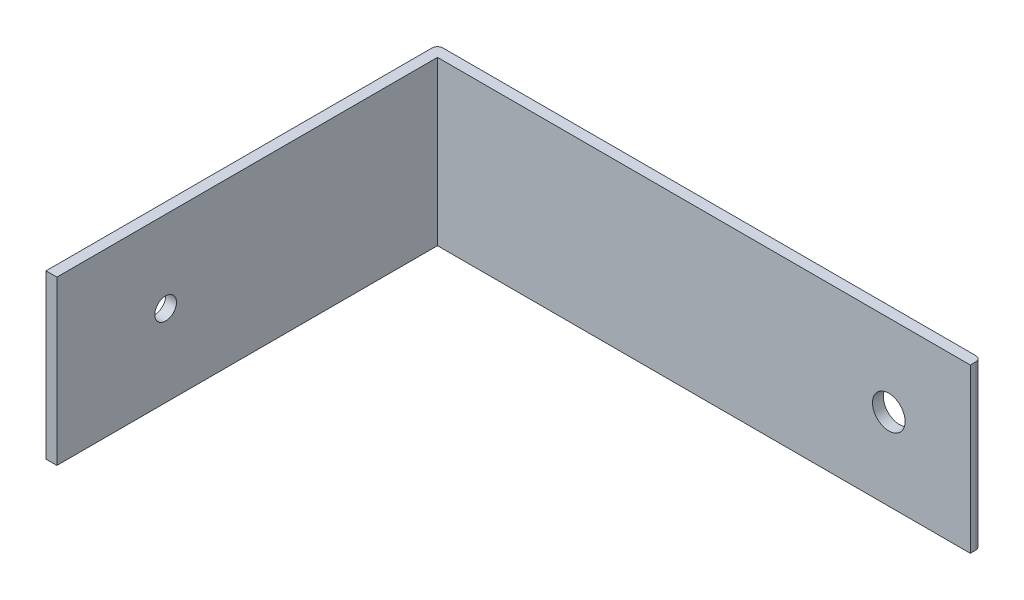
ISO-10303-21;
HEADER;
FILE_DESCRIPTION(('STEP AP214'),'2;1');
FILE_NAME('part.step','',(''),(''),'','','');
FILE_SCHEMA(('AUTOMOTIVE_DESIGN { 1 0 10303 214 1 1 1 1 }'));
ENDSEC;
DATA;
#1=APPLICATION_CONTEXT('core data for automotive mechanical design processes');
#2=APPLICATION_PROTOCOL_DEFINITION('international standard','automotive_design',2000,#1);
#3=PRODUCT_CONTEXT('',#1,'mechanical');
#4=PRODUCT('Part','Part','',(#3));
#5=PRODUCT_RELATED_PRODUCT_CATEGORY('part','',(#4));
#6=PRODUCT_DEFINITION_FORMATION('','',#4);
#7=PRODUCT_DEFINITION_CONTEXT('part definition',#1,'design');
#8=PRODUCT_DEFINITION('design','',#6,#7);
#9=PRODUCT_DEFINITION_SHAPE('','',#8);
#10=(LENGTH_UNIT() NAMED_UNIT(*) SI_UNIT(.MILLI.,.METRE.));
#11=(NAMED_UNIT(*) PLANE_ANGLE_UNIT() SI_UNIT($,.RADIAN.));
#12=(NAMED_UNIT(*) SI_UNIT($,.STERADIAN.) SOLID_ANGLE_UNIT());
#13=UNCERTAINTY_MEASURE_WITH_UNIT(LENGTH_MEASURE(1.E-05),#10,'distance_accuracy_value','');
#14=(GEOMETRIC_REPRESENTATION_CONTEXT(3) GLOBAL_UNCERTAINTY_ASSIGNED_CONTEXT((#13)) GLOBAL_UNIT_ASSIGNED_CONTEXT((#10,
#11,#12)) REPRESENTATION_CONTEXT('',''));
#15=CARTESIAN_POINT('',(0.,0.,0.));
#16=DIRECTION('',(0.,0.,1.));
#17=DIRECTION('',(1.,0.,0.));
#18=AXIS2_PLACEMENT_3D('',#15,#16,#17);
#19=CARTESIAN_POINT('',(0.,0.,2.));
#20=DIRECTION('',(1.,0.,0.));
#21=DIRECTION('',(0.,1.,0.));
#22=AXIS2_PLACEMENT_3D('',#19,#20,#21);
#23=PLANE('',#22);
#24=CARTESIAN_POINT('',(0.,-15.,52.));
#25=DIRECTION('',(-1.,0.,0.));
#26=DIRECTION('',(0.,-1.,0.));
#27=AXIS2_PLACEMENT_3D('',#24,#25,#26);
#28=CIRCLE('',#27,2.);
#29=CARTESIAN_POINT('',(0.,-17.,52.));
#30=VERTEX_POINT('',#29);
#31=EDGE_CURVE('E128',#30,#30,#28,.T.);
#32=ORIENTED_EDGE('',*,*,#31,.F.);
#33=EDGE_LOOP('',(#32));
#34=FACE_BOUND('',#33,.T.);
#35=DIRECTION('',(0.,0.,-1.));
#36=VECTOR('',#35,1.);
#37=CARTESIAN_POINT('',(0.,0.,2.));
#38=LINE('',#37,#36);
#39=CARTESIAN_POINT('',(0.,0.,72.));
#40=VERTEX_POINT('',#39);
#41=CARTESIAN_POINT('',(0.,0.,1.));
#42=VERTEX_POINT('',#41);
#43=EDGE_CURVE('E176',#40,#42,#38,.T.);
#44=ORIENTED_EDGE('',*,*,#43,.T.);
#45=DIRECTION('',(0.,-1.,0.));
#46=VECTOR('',#45,1.);
#47=CARTESIAN_POINT('',(0.,0.,1.));
#48=LINE('',#47,#46);
#49=CARTESIAN_POINT('',(0.,-30.,1.));
#50=VERTEX_POINT('',#49);
#51=EDGE_CURVE('E104',#42,#50,#48,.T.);
#52=ORIENTED_EDGE('',*,*,#51,.T.);
#53=DIRECTION('',(0.,0.,-1.));
#54=VECTOR('',#53,1.);
#55=CARTESIAN_POINT('',(0.,-30.,2.));
#56=LINE('',#55,#54);
#57=CARTESIAN_POINT('',(0.,-30.,72.));
#58=VERTEX_POINT('',#57);
#59=EDGE_CURVE('E98',#58,#50,#56,.T.);
#60=ORIENTED_EDGE('',*,*,#59,.F.);
#61=DIRECTION('',(0.,-1.,0.));
#62=VECTOR('',#61,1.);
#63=CARTESIAN_POINT('',(0.,0.,72.));
#64=LINE('',#63,#62);
#65=EDGE_CURVE('E102',#40,#58,#64,.T.);
#66=ORIENTED_EDGE('',*,*,#65,.F.);
#67=EDGE_LOOP('',(#44,#52,#60,#66));
#68=FACE_BOUND('',#67,.T.);
#69=ADVANCED_FACE('F33',(#34,#68),#23,.F.);
#70=CARTESIAN_POINT('',(0.,-30.,2.));
#71=DIRECTION('',(0.,1.,0.));
#72=DIRECTION('',(0.,0.,1.));
#73=AXIS2_PLACEMENT_3D('',#70,#71,#72);
#74=PLANE('',#73);
#75=DIRECTION('',(1.,0.,0.));
#76=VECTOR('',#75,1.);
#77=CARTESIAN_POINT('',(0.,-30.,0.));
#78=LINE('',#77,#76);
#79=CARTESIAN_POINT('',(1.,-30.,0.));
#80=VERTEX_POINT('',#79);
#81=CARTESIAN_POINT('',(99.,-30.,0.));
#82=VERTEX_POINT('',#81);
#83=EDGE_CURVE('E148',#80,#82,#78,.T.);
#84=ORIENTED_EDGE('',*,*,#83,.T.);
#85=CARTESIAN_POINT('',(99.,-30.,1.));
#86=DIRECTION('',(0.,1.,0.));
#87=DIRECTION('',(0.,0.,1.));
#88=AXIS2_PLACEMENT_3D('',#85,#86,#87);
#89=CIRCLE('',#88,1.);
#90=CARTESIAN_POINT('',(100.,-30.,1.));
#91=VERTEX_POINT('',#90);
#92=EDGE_CURVE('E11',#82,#91,#89,.F.);
#93=ORIENTED_EDGE('',*,*,#92,.T.);
#94=DIRECTION('',(0.,0.,-1.));
#95=VECTOR('',#94,1.);
#96=CARTESIAN_POINT('',(100.,-30.,2.));
#97=LINE('',#96,#95);
#98=CARTESIAN_POINT('',(100.,-30.,2.));
#99=VERTEX_POINT('',#98);
#100=EDGE_CURVE('E106',#99,#91,#97,.T.);
#101=ORIENTED_EDGE('',*,*,#100,.F.);
#102=DIRECTION('',(1.,0.,0.));
#103=VECTOR('',#102,1.);
#104=CARTESIAN_POINT('',(0.,-30.,2.));
#105=LINE('',#104,#103);
#106=CARTESIAN_POINT('',(2.,-30.,2.));
#107=VERTEX_POINT('',#106);
#108=EDGE_CURVE('E181',#107,#99,#105,.T.);
#109=ORIENTED_EDGE('',*,*,#108,.F.);
#110=DIRECTION('',(0.,0.,-1.));
#111=VECTOR('',#110,1.);
#112=CARTESIAN_POINT('',(2.,-30.,72.));
#113=LINE('',#112,#111);
#114=CARTESIAN_POINT('',(2.,-30.,72.));
#115=VERTEX_POINT('',#114);
#116=EDGE_CURVE('E113',#115,#107,#113,.T.);
#117=ORIENTED_EDGE('',*,*,#116,.F.);
#118=DIRECTION('',(1.,0.,0.));
#119=VECTOR('',#118,1.);
#120=CARTESIAN_POINT('',(0.,-30.,72.));
#121=LINE('',#120,#119);
#122=EDGE_CURVE('E109',#58,#115,#121,.T.);
#123=ORIENTED_EDGE('',*,*,#122,.F.);
#124=ORIENTED_EDGE('',*,*,#59,.T.);
#125=CARTESIAN_POINT('',(1.,-30.,1.));
#126=DIRECTION('',(0.,1.,0.));
#127=DIRECTION('',(0.,0.,1.));
#128=AXIS2_PLACEMENT_3D('',#125,#126,#127);
#129=CIRCLE('',#128,1.);
#130=EDGE_CURVE('E154',#50,#80,#129,.F.);
#131=ORIENTED_EDGE('',*,*,#130,.T.);
#132=EDGE_LOOP('',(#84,#93,#101,#109,#117,#123,#124,#131));
#133=FACE_BOUND('',#132,.T.);
#134=ADVANCED_FACE('F110',(#133),#74,.F.);
#135=CARTESIAN_POINT('',(100.,0.,2.));
#136=DIRECTION('',(-1.,0.,0.));
#137=DIRECTION('',(0.,0.,1.));
#138=AXIS2_PLACEMENT_3D('',#135,#136,#137);
#139=PLANE('',#138);
#140=ORIENTED_EDGE('',*,*,#100,.T.);
#141=DIRECTION('',(0.,1.,0.));
#142=VECTOR('',#141,1.);
#143=CARTESIAN_POINT('',(100.,0.,1.));
#144=LINE('',#143,#142);
#145=CARTESIAN_POINT('',(100.,0.,1.));
#146=VERTEX_POINT('',#145);
#147=EDGE_CURVE('E161',#91,#146,#144,.T.);
#148=ORIENTED_EDGE('',*,*,#147,.T.);
#149=DIRECTION('',(0.,0.,-1.));
#150=VECTOR('',#149,1.);
#151=CARTESIAN_POINT('',(100.,0.,2.));
#152=LINE('',#151,#150);
#153=CARTESIAN_POINT('',(100.,0.,2.));
#154=VERTEX_POINT('',#153);
#155=EDGE_CURVE('E170',#154,#146,#152,.T.);
#156=ORIENTED_EDGE('',*,*,#155,.F.);
#157=DIRECTION('',(0.,1.,0.));
#158=VECTOR('',#157,1.);
#159=CARTESIAN_POINT('',(100.,0.,2.));
#160=LINE('',#159,#158);
#161=EDGE_CURVE('E182',#99,#154,#160,.T.);
#162=ORIENTED_EDGE('',*,*,#161,.F.);
#163=EDGE_LOOP('',(#140,#148,#156,#162));
#164=FACE_BOUND('',#163,.T.);
#165=ADVANCED_FACE('F168',(#164),#139,.F.);
#166=CARTESIAN_POINT('',(0.,0.,2.));
#167=DIRECTION('',(0.,-1.,0.));
#168=DIRECTION('',(0.,0.,-1.));
#169=AXIS2_PLACEMENT_3D('',#166,#167,#168);
#170=PLANE('',#169);
#171=ORIENTED_EDGE('',*,*,#155,.T.);
#172=CARTESIAN_POINT('',(99.,0.,1.));
#173=DIRECTION('',(0.,-1.,0.));
#174=DIRECTION('',(0.,0.,-1.));
#175=AXIS2_PLACEMENT_3D('',#172,#173,#174);
#176=CIRCLE('',#175,1.);
#177=CARTESIAN_POINT('',(99.,0.,0.));
#178=VERTEX_POINT('',#177);
#179=EDGE_CURVE('E55',#146,#178,#176,.F.);
#180=ORIENTED_EDGE('',*,*,#179,.T.);
#181=DIRECTION('',(-1.,0.,0.));
#182=VECTOR('',#181,1.);
#183=CARTESIAN_POINT('',(0.,0.,0.));
#184=LINE('',#183,#182);
#185=CARTESIAN_POINT('',(1.,0.,0.));
#186=VERTEX_POINT('',#185);
#187=EDGE_CURVE('E183',#178,#186,#184,.T.);
#188=ORIENTED_EDGE('',*,*,#187,.T.);
#189=CARTESIAN_POINT('',(1.,0.,1.));
#190=DIRECTION('',(0.,-1.,0.));
#191=DIRECTION('',(0.,0.,-1.));
#192=AXIS2_PLACEMENT_3D('',#189,#190,#191);
#193=CIRCLE('',#192,1.);
#194=EDGE_CURVE('E159',#186,#42,#193,.F.);
#195=ORIENTED_EDGE('',*,*,#194,.T.);
#196=ORIENTED_EDGE('',*,*,#43,.F.);
#197=DIRECTION('',(-1.,0.,0.));
#198=VECTOR('',#197,1.);
#199=CARTESIAN_POINT('',(0.,0.,72.));
#200=LINE('',#199,#198);
#201=CARTESIAN_POINT('',(2.,0.,72.));
#202=VERTEX_POINT('',#201);
#203=EDGE_CURVE('E121',#202,#40,#200,.T.);
#204=ORIENTED_EDGE('',*,*,#203,.F.);
#205=DIRECTION('',(0.,0.,-1.));
#206=VECTOR('',#205,1.);
#207=CARTESIAN_POINT('',(2.,0.,72.));
#208=LINE('',#207,#206);
#209=CARTESIAN_POINT('',(2.,0.,2.));
#210=VERTEX_POINT('',#209);
#211=EDGE_CURVE('E133',#202,#210,#208,.T.);
#212=ORIENTED_EDGE('',*,*,#211,.T.);
#213=DIRECTION('',(-1.,0.,0.));
#214=VECTOR('',#213,1.);
#215=CARTESIAN_POINT('',(0.,0.,2.));
#216=LINE('',#215,#214);
#217=EDGE_CURVE('E140',#154,#210,#216,.T.);
#218=ORIENTED_EDGE('',*,*,#217,.F.);
#219=EDGE_LOOP('',(#171,#180,#188,#195,#196,#204,#212,#218));
#220=FACE_BOUND('',#219,.T.);
#221=ADVANCED_FACE('F175',(#220),#170,.F.);
#222=CARTESIAN_POINT('',(0.,0.,2.));
#223=DIRECTION('',(0.,0.,1.));
#224=DIRECTION('',(1.,0.,0.));
#225=AXIS2_PLACEMENT_3D('',#222,#223,#224);
#226=PLANE('',#225);
#227=CARTESIAN_POINT('',(85.,-15.,2.));
#228=DIRECTION('',(0.,0.,1.));
#229=DIRECTION('',(1.,0.,0.));
#230=AXIS2_PLACEMENT_3D('',#227,#228,#229);
#231=CIRCLE('',#230,3.00000000000001);
#232=CARTESIAN_POINT('',(88.,-15.,2.));
#233=VERTEX_POINT('',#232);
#234=EDGE_CURVE('E236',#233,#233,#231,.T.);
#235=ORIENTED_EDGE('',*,*,#234,.F.);
#236=EDGE_LOOP('',(#235));
#237=FACE_BOUND('',#236,.T.);
#238=DIRECTION('',(0.,1.,0.));
#239=VECTOR('',#238,1.);
#240=CARTESIAN_POINT('',(2.,0.,2.));
#241=LINE('',#240,#239);
#242=EDGE_CURVE('E122',#107,#210,#241,.T.);
#243=ORIENTED_EDGE('',*,*,#242,.F.);
#244=ORIENTED_EDGE('',*,*,#108,.T.);
#245=ORIENTED_EDGE('',*,*,#161,.T.);
#246=ORIENTED_EDGE('',*,*,#217,.T.);
#247=EDGE_LOOP('',(#243,#244,#245,#246));
#248=FACE_BOUND('',#247,.T.);
#249=ADVANCED_FACE('F212',(#237,#248),#226,.T.);
#250=CARTESIAN_POINT('',(0.,0.,0.));
#251=DIRECTION('',(0.,0.,1.));
#252=DIRECTION('',(1.,0.,0.));
#253=AXIS2_PLACEMENT_3D('',#250,#251,#252);
#254=PLANE('',#253);
#255=CARTESIAN_POINT('',(85.,-15.,0.));
#256=DIRECTION('',(0.,0.,-1.));
#257=DIRECTION('',(-1.,0.,0.));
#258=AXIS2_PLACEMENT_3D('',#255,#256,#257);
#259=CIRCLE('',#258,3.00000000000001);
#260=CARTESIAN_POINT('',(82.,-15.,0.));
#261=VERTEX_POINT('',#260);
#262=EDGE_CURVE('E238',#261,#261,#259,.T.);
#263=ORIENTED_EDGE('',*,*,#262,.F.);
#264=EDGE_LOOP('',(#263));
#265=FACE_BOUND('',#264,.T.);
#266=ORIENTED_EDGE('',*,*,#187,.F.);
#267=DIRECTION('',(0.,1.,0.));
#268=VECTOR('',#267,1.);
#269=CARTESIAN_POINT('',(99.,0.,0.));
#270=LINE('',#269,#268);
#271=EDGE_CURVE('E41',#178,#82,#270,.F.);
#272=ORIENTED_EDGE('',*,*,#271,.T.);
#273=ORIENTED_EDGE('',*,*,#83,.F.);
#274=DIRECTION('',(0.,-1.,0.));
#275=VECTOR('',#274,1.);
#276=CARTESIAN_POINT('',(1.,0.,0.));
#277=LINE('',#276,#275);
#278=EDGE_CURVE('E156',#80,#186,#277,.F.);
#279=ORIENTED_EDGE('',*,*,#278,.T.);
#280=EDGE_LOOP('',(#266,#272,#273,#279));
#281=FACE_BOUND('',#280,.T.);
#282=ADVANCED_FACE('F213',(#265,#281),#254,.F.);
#283=CARTESIAN_POINT('',(2.,0.,72.));
#284=DIRECTION('',(-1.,0.,0.));
#285=DIRECTION('',(0.,-1.,0.));
#286=AXIS2_PLACEMENT_3D('',#283,#284,#285);
#287=PLANE('',#286);
#288=CARTESIAN_POINT('',(2.,-15.,52.));
#289=DIRECTION('',(-1.,0.,0.));
#290=DIRECTION('',(0.,-1.,0.));
#291=AXIS2_PLACEMENT_3D('',#288,#289,#290);
#292=CIRCLE('',#291,2.);
#293=CARTESIAN_POINT('',(2.,-17.,52.));
#294=VERTEX_POINT('',#293);
#295=EDGE_CURVE('E125',#294,#294,#292,.T.);
#296=ORIENTED_EDGE('',*,*,#295,.T.);
#297=EDGE_LOOP('',(#296));
#298=FACE_BOUND('',#297,.T.);
#299=ORIENTED_EDGE('',*,*,#242,.T.);
#300=ORIENTED_EDGE('',*,*,#211,.F.);
#301=DIRECTION('',(0.,1.,0.));
#302=VECTOR('',#301,1.);
#303=CARTESIAN_POINT('',(2.,0.,72.));
#304=LINE('',#303,#302);
#305=EDGE_CURVE('E116',#115,#202,#304,.T.);
#306=ORIENTED_EDGE('',*,*,#305,.F.);
#307=ORIENTED_EDGE('',*,*,#116,.T.);
#308=EDGE_LOOP('',(#299,#300,#306,#307));
#309=FACE_BOUND('',#308,.T.);
#310=ADVANCED_FACE('F216',(#298,#309),#287,.F.);
#311=CARTESIAN_POINT('',(0.,0.,72.));
#312=DIRECTION('',(0.,0.,1.));
#313=DIRECTION('',(1.,0.,0.));
#314=AXIS2_PLACEMENT_3D('',#311,#312,#313);
#315=PLANE('',#314);
#316=ORIENTED_EDGE('',*,*,#65,.T.);
#317=ORIENTED_EDGE('',*,*,#122,.T.);
#318=ORIENTED_EDGE('',*,*,#305,.T.);
#319=ORIENTED_EDGE('',*,*,#203,.T.);
#320=EDGE_LOOP('',(#316,#317,#318,#319));
#321=FACE_BOUND('',#320,.T.);
#322=ADVANCED_FACE('F119',(#321),#315,.T.);
#323=CARTESIAN_POINT('',(100.000025,-15.,52.));
#324=DIRECTION('',(-1.,0.,0.));
#325=DIRECTION('',(0.,-1.,0.));
#326=AXIS2_PLACEMENT_3D('',#323,#324,#325);
#327=CYLINDRICAL_SURFACE('',#326,2.);
#328=ORIENTED_EDGE('',*,*,#31,.T.);
#329=EDGE_LOOP('',(#328));
#330=FACE_BOUND('',#329,.T.);
#331=ORIENTED_EDGE('',*,*,#295,.F.);
#332=EDGE_LOOP('',(#331));
#333=FACE_BOUND('',#332,.T.);
#334=ADVANCED_FACE('F197',(#330,#333),#327,.F.);
#335=CARTESIAN_POINT('',(1.,0.,1.));
#336=DIRECTION('',(0.,-1.,0.));
#337=DIRECTION('',(1.,0.,0.));
#338=AXIS2_PLACEMENT_3D('',#335,#336,#337);
#339=CYLINDRICAL_SURFACE('',#338,1.);
#340=ORIENTED_EDGE('',*,*,#194,.F.);
#341=ORIENTED_EDGE('',*,*,#278,.F.);
#342=ORIENTED_EDGE('',*,*,#130,.F.);
#343=ORIENTED_EDGE('',*,*,#51,.F.);
#344=EDGE_LOOP('',(#340,#341,#342,#343));
#345=FACE_BOUND('',#344,.T.);
#346=ADVANCED_FACE('F190',(#345),#339,.T.);
#347=CARTESIAN_POINT('',(99.,0.,1.));
#348=DIRECTION('',(0.,1.,0.));
#349=DIRECTION('',(0.,0.,1.));
#350=AXIS2_PLACEMENT_3D('',#347,#348,#349);
#351=CYLINDRICAL_SURFACE('',#350,1.);
#352=ORIENTED_EDGE('',*,*,#92,.F.);
#353=ORIENTED_EDGE('',*,*,#271,.F.);
#354=ORIENTED_EDGE('',*,*,#179,.F.);
#355=ORIENTED_EDGE('',*,*,#147,.F.);
#356=EDGE_LOOP('',(#352,#353,#354,#355));
#357=FACE_BOUND('',#356,.T.);
#358=ADVANCED_FACE('F35',(#357),#351,.T.);
#359=CARTESIAN_POINT('',(85.,-15.,10.));
#360=DIRECTION('',(0.,0.,-1.));
#361=DIRECTION('',(-1.,0.,0.));
#362=AXIS2_PLACEMENT_3D('',#359,#360,#361);
#363=CYLINDRICAL_SURFACE('',#362,3.00000000000001);
#364=ORIENTED_EDGE('',*,*,#234,.T.);
#365=EDGE_LOOP('',(#364));
#366=FACE_BOUND('',#365,.T.);
#367=ORIENTED_EDGE('',*,*,#262,.T.);
#368=EDGE_LOOP('',(#367));
#369=FACE_BOUND('',#368,.T.);
#370=ADVANCED_FACE('F189',(#366,#369),#363,.F.);
#371=CLOSED_SHELL('',(#69,#134,#165,#221,#249,#282,#310,#322,#334,#346,#358,#370));
#372=MANIFOLD_SOLID_BREP('B2',#371);
#373=ADVANCED_BREP_SHAPE_REPRESENTATION('',(#18,#372),#14);
#374=SHAPE_DEFINITION_REPRESENTATION(#9,#373);
ENDSEC;
END-ISO-10303-21;
